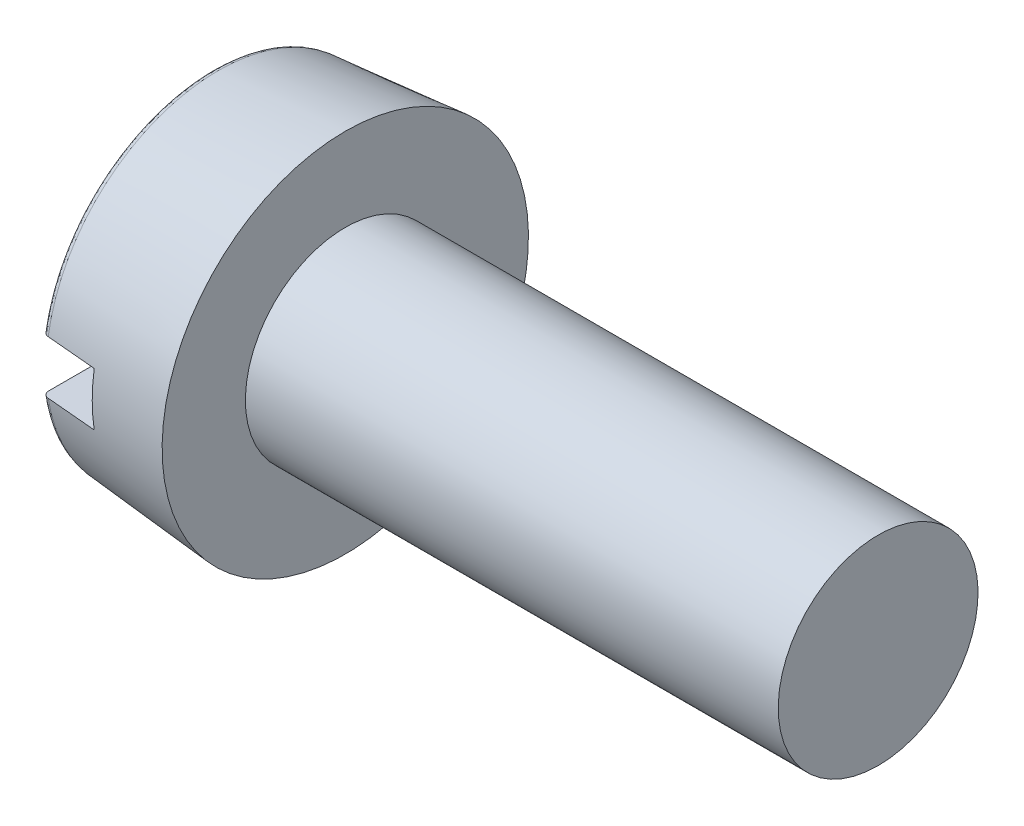
ISO-10303-21;
HEADER;
FILE_DESCRIPTION(('STEP AP214'),'2;1');
FILE_NAME('part.step','',(''),(''),'','','');
FILE_SCHEMA(('AUTOMOTIVE_DESIGN { 1 0 10303 214 1 1 1 1 }'));
ENDSEC;
DATA;
#1=APPLICATION_CONTEXT('core data for automotive mechanical design processes');
#2=APPLICATION_PROTOCOL_DEFINITION('international standard','automotive_design',2000,#1);
#3=PRODUCT_CONTEXT('',#1,'mechanical');
#4=PRODUCT('Part','Part','',(#3));
#5=PRODUCT_RELATED_PRODUCT_CATEGORY('part','',(#4));
#6=PRODUCT_DEFINITION_FORMATION('','',#4);
#7=PRODUCT_DEFINITION_CONTEXT('part definition',#1,'design');
#8=PRODUCT_DEFINITION('design','',#6,#7);
#9=PRODUCT_DEFINITION_SHAPE('','',#8);
#10=(LENGTH_UNIT() NAMED_UNIT(*) SI_UNIT(.MILLI.,.METRE.));
#11=(NAMED_UNIT(*) PLANE_ANGLE_UNIT() SI_UNIT($,.RADIAN.));
#12=(NAMED_UNIT(*) SI_UNIT($,.STERADIAN.) SOLID_ANGLE_UNIT());
#13=UNCERTAINTY_MEASURE_WITH_UNIT(LENGTH_MEASURE(1.E-05),#10,'distance_accuracy_value','');
#14=(GEOMETRIC_REPRESENTATION_CONTEXT(3) GLOBAL_UNCERTAINTY_ASSIGNED_CONTEXT((#13)) GLOBAL_UNIT_ASSIGNED_CONTEXT((#10,
#11,#12)) REPRESENTATION_CONTEXT('',''));
#15=CARTESIAN_POINT('',(0.,0.,0.));
#16=DIRECTION('',(0.,0.,1.));
#17=DIRECTION('',(1.,0.,0.));
#18=AXIS2_PLACEMENT_3D('',#15,#16,#17);
#19=CARTESIAN_POINT('',(0.,-0.4,2.650446542));
#20=DIRECTION('',(0.,-1.,0.));
#21=DIRECTION('',(0.,0.,-1.));
#22=AXIS2_PLACEMENT_3D('',#19,#20,#21);
#23=PLANE('',#22);
#24=CARTESIAN_POINT('',(-3.88264754801787E-10,-0.4,-2.45096382721289));
#25=CARTESIAN_POINT('',(8.23469277590213E-07,-0.400000000000683,-2.45672147849652));
#26=CARTESIAN_POINT('',(0.000485740539162257,-0.400000000000431,-2.46246889609489));
#27=CARTESIAN_POINT('',(0.00240753486794676,-0.399999999999569,-2.47380010316481));
#28=CARTESIAN_POINT('',(0.00384409442476151,-0.399999999998958,-2.47938394659553));
#29=CARTESIAN_POINT('',(0.00954542054326699,-0.399999999998849,-2.49564714861891));
#30=CARTESIAN_POINT('',(0.0152020603181267,-0.400000000001058,-2.50587617527297));
#31=CARTESIAN_POINT('',(0.0295560275156081,-0.399999999998943,-2.52377256067412));
#32=CARTESIAN_POINT('',(0.0382333783044966,-0.399999999994662,-2.53145611716201));
#33=CARTESIAN_POINT('',(0.0575844854018703,-0.399999999994604,-2.54337606647098));
#34=CARTESIAN_POINT('',(0.0682327265056606,-0.399999999998725,-2.54765317542582));
#35=CARTESIAN_POINT('',(0.0832192883416446,-0.400000000000461,-2.5508884248263));
#36=CARTESIAN_POINT('',(0.0872441554275944,-0.40000000000055,-2.55149900085297));
#37=CARTESIAN_POINT('',(0.0912844258242664,-0.399999999999937,-2.55184945172854));
#38=B_SPLINE_CURVE_WITH_KNOTS('',3,(#24,#25,#26,#27,#28,#29,#30,#31,#32,#33,#34,#35,#36,#37),
.UNSPECIFIED.,.F.,.F.,(4,2,2,2,2,2,4),(0.,0.0172324601899396,0.0344591702884396,
0.0688041676320151,0.102926218379292,0.13663402778301,0.148813672108883),.UNSPECIFIED.);
#39=CARTESIAN_POINT('',(-1.55305900850545E-10,-0.400000000229972,-2.45096382721289));
#40=VERTEX_POINT('',#39);
#41=CARTESIAN_POINT('',(0.0912844259120966,-0.399999999999968,-2.5518494516251));
#42=VERTEX_POINT('',#41);
#43=EDGE_CURVE('E100',#40,#42,#38,.T.);
#44=ORIENTED_EDGE('',*,*,#43,.F.);
#45=DIRECTION('',(0.,0.,-1.));
#46=VECTOR('',#45,1.);
#47=CARTESIAN_POINT('',(0.,-0.4,0.));
#48=LINE('',#47,#46);
#49=CARTESIAN_POINT('',(-1.55305900850545E-10,-0.400000000229972,2.45096382721289));
#50=VERTEX_POINT('',#49);
#51=EDGE_CURVE('E93',#50,#40,#48,.T.);
#52=ORIENTED_EDGE('',*,*,#51,.F.);
#53=CARTESIAN_POINT('',(0.0912844258227498,-0.4,2.5518494517284));
#54=CARTESIAN_POINT('',(0.0857148648744234,-0.400000000000016,2.55135621638075));
#55=CARTESIAN_POINT('',(0.0801975998035407,-0.400000000000008,2.5503899754913));
#56=CARTESIAN_POINT('',(0.069409338122753,-0.399999999999992,2.54754766453578));
#57=CARTESIAN_POINT('',(0.0641380702907059,-0.399999999999985,2.54567262374717));
#58=CARTESIAN_POINT('',(0.0489193196515725,-0.400000000000031,2.53875010258025));
#59=CARTESIAN_POINT('',(0.0395291097761964,-0.400000000000155,2.53240156020649));
#60=CARTESIAN_POINT('',(0.0233108199671268,-0.399999999999848,2.51695392511927));
#61=CARTESIAN_POINT('',(0.0164994426360841,-0.399999999999413,2.50783756819865));
#62=CARTESIAN_POINT('',(0.00615284354292489,-0.399999999999386,2.48774464580124));
#63=CARTESIAN_POINT('',(0.00265801971679152,-0.399999999999802,2.47674702132579));
#64=CARTESIAN_POINT('',(0.000340734068961633,-0.400000000000085,2.46069313066721));
#65=CARTESIAN_POINT('',(-9.49251235962126E-06,-0.40000000000013,2.45582329079742));
#66=CARTESIAN_POINT('',(-3.88264754859766E-10,-0.400000000000083,2.45096382721327));
#67=B_SPLINE_CURVE_WITH_KNOTS('',3,(#53,#54,#55,#56,#57,#58,#59,#60,#61,#62,#63,#64,#65,#66),
.UNSPECIFIED.,.F.,.F.,(4,2,2,2,2,2,4),(0.,0.0167339512516012,0.0334489942994423,
0.0667708029238235,0.100304881525151,0.134242375441344,0.148836154643942),.UNSPECIFIED.);
#68=CARTESIAN_POINT('',(0.0912844259211104,-0.4,2.55184945151469));
#69=VERTEX_POINT('',#68);
#70=EDGE_CURVE('E79',#69,#50,#67,.T.);
#71=ORIENTED_EDGE('',*,*,#70,.F.);
#72=CARTESIAN_POINT('',(0.850000000094597,-0.400000000175783,2.619018321802));
#73=CARTESIAN_POINT('',(0.72354710573568,-0.400000000087891,2.60782688353553));
#74=CARTESIAN_POINT('',(0.597094360702005,-0.400000000029297,2.59663375854446));
#75=CARTESIAN_POINT('',(0.344189169284567,-0.399999999970703,2.57424413511303));
#76=CARTESIAN_POINT('',(0.217736722900805,-0.399999999970703,2.56304763667267));
#77=CARTESIAN_POINT('',(0.0912844258422845,-0.4,2.5518494515077));
#78=B_SPLINE_CURVE_WITH_KNOTS('',3,(#72,#73,#74,#75,#76,#77),.UNSPECIFIED.,.F.,.F.,(4,2,4),(0.,
0.380841495851696,0.761682991705114),.UNSPECIFIED.);
#79=CARTESIAN_POINT('',(0.850000000275011,-0.4,2.61901832166631));
#80=VERTEX_POINT('',#79);
#81=EDGE_CURVE('E21',#80,#69,#78,.T.);
#82=ORIENTED_EDGE('',*,*,#81,.F.);
#83=DIRECTION('',(0.,0.,-1.));
#84=VECTOR('',#83,1.);
#85=CARTESIAN_POINT('',(0.85,-0.4,0.));
#86=LINE('',#85,#84);
#87=CARTESIAN_POINT('',(0.850000000275822,-0.4,-2.61901832166638));
#88=VERTEX_POINT('',#87);
#89=EDGE_CURVE('E77',#80,#88,#86,.T.);
#90=ORIENTED_EDGE('',*,*,#89,.T.);
#91=CARTESIAN_POINT('',(0.0912844258327621,-0.400000000147707,-2.55184945163379));
#92=CARTESIAN_POINT('',(0.217736722894637,-0.400000000073854,-2.56304763676087));
#93=CARTESIAN_POINT('',(0.344189169282115,-0.400000000024618,-2.57424413515924));
#94=CARTESIAN_POINT('',(0.597094360707707,-0.399999999975382,-2.59663375849853));
#95=CARTESIAN_POINT('',(0.723547105745822,-0.399999999975382,-2.60782688343945));
#96=CARTESIAN_POINT('',(0.85000000010954,-0.4,-2.61901832165167));
#97=B_SPLINE_CURVE_WITH_KNOTS('',3,(#91,#92,#93,#94,#95,#96),.UNSPECIFIED.,.F.,.F.,(4,2,4),(0.,
0.380841495853413,0.761682991705108),.UNSPECIFIED.);
#98=EDGE_CURVE('E97',#42,#88,#97,.T.);
#99=ORIENTED_EDGE('',*,*,#98,.F.);
#100=EDGE_LOOP('',(#44,#52,#71,#82,#90,#99));
#101=FACE_BOUND('',#100,.T.);
#102=ADVANCED_FACE('F17',(#101),#23,.F.);
#103=CARTESIAN_POINT('',(0.85,-0.4,2.681180693));
#104=DIRECTION('',(1.,0.,0.));
#105=DIRECTION('',(0.,0.,-1.));
#106=AXIS2_PLACEMENT_3D('',#103,#104,#105);
#107=PLANE('',#106);
#108=CARTESIAN_POINT('',(0.850000000442108,0.,0.));
#109=DIRECTION('',(1.,0.,0.));
#110=DIRECTION('',(0.,1.,0.));
#111=AXIS2_PLACEMENT_3D('',#108,#109,#110);
#112=CIRCLE('',#111,2.64938803675514);
#113=CARTESIAN_POINT('',(0.850000000255486,0.4,2.61901832166458));
#114=VERTEX_POINT('',#113);
#115=EDGE_CURVE('E84',#114,#80,#112,.T.);
#116=ORIENTED_EDGE('',*,*,#115,.F.);
#117=DIRECTION('',(0.,0.,-1.));
#118=VECTOR('',#117,1.);
#119=CARTESIAN_POINT('',(0.85,0.4,0.));
#120=LINE('',#119,#118);
#121=CARTESIAN_POINT('',(0.850000000221054,0.4,-2.61901832166153));
#122=VERTEX_POINT('',#121);
#123=EDGE_CURVE('E104',#114,#122,#120,.T.);
#124=ORIENTED_EDGE('',*,*,#123,.T.);
#125=CARTESIAN_POINT('',(0.850000000442108,0.,0.));
#126=DIRECTION('',(1.,0.,0.));
#127=DIRECTION('',(0.,1.,0.));
#128=AXIS2_PLACEMENT_3D('',#125,#126,#127);
#129=CIRCLE('',#128,2.64938803675514);
#130=EDGE_CURVE('E94',#88,#122,#129,.T.);
#131=ORIENTED_EDGE('',*,*,#130,.F.);
#132=ORIENTED_EDGE('',*,*,#89,.F.);
#133=EDGE_LOOP('',(#116,#124,#131,#132));
#134=FACE_BOUND('',#133,.T.);
#135=ADVANCED_FACE('F96',(#134),#107,.F.);
#136=CARTESIAN_POINT('',(0.,-2.495889893,-2.480375394));
#137=DIRECTION('',(-1.,0.,0.));
#138=DIRECTION('',(0.,0.,1.));
#139=AXIS2_PLACEMENT_3D('',#136,#137,#138);
#140=PLANE('',#139);
#141=ORIENTED_EDGE('',*,*,#51,.T.);
#142=CARTESIAN_POINT('',(-3.88264752088621E-10,-0.342851183630537,2.45960906493691));
#143=CARTESIAN_POINT('',(-3.8826475132627E-10,-4.1607756227118,1.9274188353991));
#144=CARTESIAN_POINT('',(-3.8826475132627E-10,-4.1607756227118,-1.9274188353991));
#145=CARTESIAN_POINT('',(-3.88264752088621E-10,-0.342851183630537,-2.45960906493691));
#146=(BOUNDED_CURVE() B_SPLINE_CURVE(3,(#142,#143,#144,#145),.UNSPECIFIED.,.F.,
.F.) B_SPLINE_CURVE_WITH_KNOTS((4,4),(0.,1.),
.UNSPECIFIED.) CURVE() GEOMETRIC_REPRESENTATION_ITEM() RATIONAL_B_SPLINE_CURVE((0.95905674209149,
0.407955726950188,0.407955726950188,0.95905674209149)) REPRESENTATION_ITEM(''));
#147=EDGE_CURVE('E111',#50,#40,#146,.T.);
#148=ORIENTED_EDGE('',*,*,#147,.F.);
#149=EDGE_LOOP('',(#141,#148));
#150=FACE_BOUND('',#149,.T.);
#151=ADVANCED_FACE('F118',(#150),#140,.T.);
#152=CARTESIAN_POINT('',(0.,0.4,-2.650446542));
#153=DIRECTION('',(0.,1.,0.));
#154=DIRECTION('',(0.,0.,1.));
#155=AXIS2_PLACEMENT_3D('',#152,#153,#154);
#156=PLANE('',#155);
#157=ORIENTED_EDGE('',*,*,#123,.F.);
#158=CARTESIAN_POINT('',(0.09128442584827,0.399999999997224,2.55184945150585));
#159=CARTESIAN_POINT('',(0.217736722896994,0.399999999998612,2.56304763669642));
#160=CARTESIAN_POINT('',(0.344189169273215,0.399999999999537,2.5742441351369));
#161=CARTESIAN_POINT('',(0.597094360680079,0.400000000000463,2.59663375851764));
#162=CARTESIAN_POINT('',(0.723547105710723,0.400000000000463,2.60782688345789));
#163=CARTESIAN_POINT('',(0.850000000068864,0.4,2.61901832164807));
#164=B_SPLINE_CURVE_WITH_KNOTS('',3,(#158,#159,#160,#161,#162,#163),.UNSPECIFIED.,.F.,.F.,(4,2,
4),(0.,0.380841495830915,0.76168299166011),.UNSPECIFIED.);
#165=CARTESIAN_POINT('',(0.0912844259141692,0.399999999999969,2.55184945162529));
#166=VERTEX_POINT('',#165);
#167=EDGE_CURVE('E89',#166,#114,#164,.T.);
#168=ORIENTED_EDGE('',*,*,#167,.F.);
#169=CARTESIAN_POINT('',(-3.88264754899792E-10,0.4,2.45096382721288));
#170=CARTESIAN_POINT('',(8.23469276589504E-07,0.400000000000683,2.4567214784965));
#171=CARTESIAN_POINT('',(0.00048574053916007,0.400000000000431,2.46246889609487));
#172=CARTESIAN_POINT('',(0.00240753486794207,0.399999999999569,2.47380010316479));
#173=CARTESIAN_POINT('',(0.00384409442475547,0.399999999998958,2.47938394659551));
#174=CARTESIAN_POINT('',(0.00954542054325717,0.399999999998849,2.4956471486189));
#175=CARTESIAN_POINT('',(0.0152020603181147,0.400000000001058,2.50587617527295));
#176=CARTESIAN_POINT('',(0.029556027515593,0.399999999998943,2.52377256067411));
#177=CARTESIAN_POINT('',(0.0382333783044807,0.399999999994662,2.531456117162));
#178=CARTESIAN_POINT('',(0.0575844854018479,0.399999999994604,2.54337606647098));
#179=CARTESIAN_POINT('',(0.0682327265056326,0.399999999998725,2.54765317542581));
#180=CARTESIAN_POINT('',(0.0832192883429883,0.400000000000461,2.5508884248266));
#181=CARTESIAN_POINT('',(0.0872441554303379,0.40000000000055,2.5514990008534));
#182=CARTESIAN_POINT('',(0.0912844258284116,0.399999999999937,2.55184945172891));
#183=B_SPLINE_CURVE_WITH_KNOTS('',3,(#169,#170,#171,#172,#173,#174,#175,#176,#177,#178,#179,
#180,#181,#182),.UNSPECIFIED.,.F.,.F.,(4,2,2,2,2,2,4),(0.,0.0172324601899393,0.0344591702884387,
0.0688041676320139,0.10292621837929,0.136634027783007,0.148813672113057),.UNSPECIFIED.);
#184=CARTESIAN_POINT('',(-1.55305900841723E-10,0.400000000230091,2.45096382721288));
#185=VERTEX_POINT('',#184);
#186=EDGE_CURVE('E41',#185,#166,#183,.T.);
#187=ORIENTED_EDGE('',*,*,#186,.F.);
#188=DIRECTION('',(0.,0.,1.));
#189=VECTOR('',#188,1.);
#190=CARTESIAN_POINT('',(0.,0.4,0.));
#191=LINE('',#190,#189);
#192=CARTESIAN_POINT('',(-1.55305900841723E-10,0.400000000230092,-2.45096382721288));
#193=VERTEX_POINT('',#192);
#194=EDGE_CURVE('E189',#193,#185,#191,.T.);
#195=ORIENTED_EDGE('',*,*,#194,.F.);
#196=CARTESIAN_POINT('',(0.0912844258256326,0.4,-2.55184945172866));
#197=CARTESIAN_POINT('',(0.0857148648772951,0.400000000000016,-2.55135621638117));
#198=CARTESIAN_POINT('',(0.0801975998063876,0.400000000000008,-2.55038997549189));
#199=CARTESIAN_POINT('',(0.0694093381255233,0.399999999999992,-2.54754766453668));
#200=CARTESIAN_POINT('',(0.0641380702934247,0.399999999999985,-2.54567262374823));
#201=CARTESIAN_POINT('',(0.0489193196540978,0.400000000000032,-2.53875010258176));
#202=CARTESIAN_POINT('',(0.0395291097785408,0.400000000000155,-2.53240156020827));
#203=CARTESIAN_POINT('',(0.0233108199690319,0.399999999999848,-2.51695392512154));
#204=CARTESIAN_POINT('',(0.0164994426377294,0.399999999999414,-2.50783756820113));
#205=CARTESIAN_POINT('',(0.00615284354399601,0.399999999999385,-2.48774464580404));
#206=CARTESIAN_POINT('',(0.00265801971754725,0.399999999999801,-2.47674702132872));
#207=CARTESIAN_POINT('',(0.000340734069101161,0.400000000000085,-2.4606931306692));
#208=CARTESIAN_POINT('',(-9.49251236520458E-06,0.40000000000013,-2.45582329079841));
#209=CARTESIAN_POINT('',(-3.8826475501002E-10,0.400000000000084,-2.45096382721325));
#210=B_SPLINE_CURVE_WITH_KNOTS('',3,(#196,#197,#198,#199,#200,#201,#202,#203,#204,#205,#206,
#207,#208,#209),.UNSPECIFIED.,.F.,.F.,(4,2,2,2,2,2,4),(0.,0.0167339512515908,0.0334489942994217,
0.066770802923782,0.100304881525078,0.134242375441233,0.14883615464685),.UNSPECIFIED.);
#211=CARTESIAN_POINT('',(0.0912844259225519,0.4,-2.55184945151482));
#212=VERTEX_POINT('',#211);
#213=EDGE_CURVE('E156',#212,#193,#210,.T.);
#214=ORIENTED_EDGE('',*,*,#213,.F.);
#215=CARTESIAN_POINT('',(0.850000000073007,0.4,-2.61901832164843));
#216=CARTESIAN_POINT('',(0.723547105713729,0.4,-2.60782688345776));
#217=CARTESIAN_POINT('',(0.597094360681914,0.4,-2.5966337585174));
#218=CARTESIAN_POINT('',(0.344189169272636,0.4,-2.57424413513724));
#219=CARTESIAN_POINT('',(0.217736722895173,0.4,-2.56304763669745));
#220=CARTESIAN_POINT('',(0.0912844258451723,0.4,-2.55184945150796));
#221=B_SPLINE_CURVE_WITH_KNOTS('',3,(#215,#216,#217,#218,#219,#220),.UNSPECIFIED.,.F.,.F.,(4,2,
4),(0.,0.380841495832725,0.761682991667168),.UNSPECIFIED.);
#222=EDGE_CURVE('E137',#122,#212,#221,.T.);
#223=ORIENTED_EDGE('',*,*,#222,.F.);
#224=EDGE_LOOP('',(#157,#168,#187,#195,#214,#223));
#225=FACE_BOUND('',#224,.T.);
#226=ADVANCED_FACE('F128',(#225),#156,.F.);
#227=CARTESIAN_POINT('',(0.000499583,-0.341472906,-2.449721322));
#228=CARTESIAN_POINT('',(0.000499583,-4.144049111,-1.919670522));
#229=CARTESIAN_POINT('',(0.000499583,-4.144049111,1.919670522));
#230=CARTESIAN_POINT('',(0.000499583,-0.341472906,2.449721322));
#231=CARTESIAN_POINT('',(-0.005885351,-0.3502584,-2.512748324));
#232=CARTESIAN_POINT('',(-0.005885351,-4.250668174,-1.969060253));
#233=CARTESIAN_POINT('',(-0.005885351,-4.250668174,1.969060253));
#234=CARTESIAN_POINT('',(-0.005885351,-0.3502584,2.512748324));
#235=CARTESIAN_POINT('',(0.037322619,-0.356768269,-2.559450018));
#236=CARTESIAN_POINT('',(0.037322619,-4.329670676,-2.005657014));
#237=CARTESIAN_POINT('',(0.037322619,-4.329670676,2.005657014));
#238=CARTESIAN_POINT('',(0.037322619,-0.356768269,2.559450018));
#239=CARTESIAN_POINT('',(0.101273319,-0.356655839,-2.558643453));
#240=CARTESIAN_POINT('',(0.101273319,-4.328306259,-2.005024967));
#241=CARTESIAN_POINT('',(0.101273319,-4.328306259,2.005024967));
#242=CARTESIAN_POINT('',(0.101273319,-0.356655839,2.558643453));
#243=(BOUNDED_SURFACE() B_SPLINE_SURFACE(3,3,((#227,#228,#229,#230),(#231,#232,#233,#234),(#235,
#236,#237,#238),(#239,#240,#241,#242)),.UNSPECIFIED.,.F.,.F.,
.F.) B_SPLINE_SURFACE_WITH_KNOTS((4,4),(4,4),(0.,1.),(0.,1.),
.UNSPECIFIED.) GEOMETRIC_REPRESENTATION_ITEM() RATIONAL_B_SPLINE_SURFACE(((1.,0.425371835727391,
0.425371835727391,1.),(0.77743169494117,0.330697547229782,0.330697547229782,0.77743169494117),
(0.77743169494117,0.330697547229782,0.330697547229782,0.77743169494117),(1.,0.425371835727391,
0.425371835727391,1.))) REPRESENTATION_ITEM('') SURFACE());
#244=CARTESIAN_POINT('',(0.0912844259999268,0.,0.));
#245=DIRECTION('',(1.,0.,0.));
#246=DIRECTION('',(0.,0.,-1.));
#247=AXIS2_PLACEMENT_3D('',#244,#245,#246);
#248=CIRCLE('',#247,2.583009025);
#249=EDGE_CURVE('E181',#42,#69,#248,.F.);
#250=ORIENTED_EDGE('',*,*,#70,.T.);
#251=ORIENTED_EDGE('',*,*,#147,.T.);
#252=ORIENTED_EDGE('',*,*,#43,.T.);
#253=ORIENTED_EDGE('',*,*,#249,.T.);
#254=EDGE_LOOP('',(#250,#251,#252,#253));
#255=FACE_BOUND('',#254,.T.);
#256=ADVANCED_FACE('F132',(#255),#243,.T.);
#257=CARTESIAN_POINT('',(10.,-1.518,1.518));
#258=DIRECTION('',(1.,0.,0.));
#259=DIRECTION('',(0.,0.,-1.));
#260=AXIS2_PLACEMENT_3D('',#257,#258,#259);
#261=PLANE('',#260);
#262=CARTESIAN_POINT('',(10.,0.,0.));
#263=DIRECTION('',(-1.,0.,0.));
#264=DIRECTION('',(0.,-1.,0.));
#265=AXIS2_PLACEMENT_3D('',#262,#263,#264);
#266=CIRCLE('',#265,1.5);
#267=CARTESIAN_POINT('',(10.,-1.5,0.));
#268=VERTEX_POINT('',#267);
#269=EDGE_CURVE('E188',#268,#268,#266,.F.);
#270=ORIENTED_EDGE('',*,*,#269,.T.);
#271=EDGE_LOOP('',(#270));
#272=FACE_BOUND('',#271,.T.);
#273=ADVANCED_FACE('F133',(#272),#261,.T.);
#274=CARTESIAN_POINT('',(0.,0.4,-2.480375394));
#275=DIRECTION('',(-1.,0.,0.));
#276=DIRECTION('',(0.,0.,1.));
#277=AXIS2_PLACEMENT_3D('',#274,#275,#276);
#278=PLANE('',#277);
#279=ORIENTED_EDGE('',*,*,#194,.T.);
#280=CARTESIAN_POINT('',(-3.88264752064926E-10,0.342851183630537,-2.45960906493691));
#281=CARTESIAN_POINT('',(-3.88264751740256E-10,4.1607756227118,-1.9274188353991));
#282=CARTESIAN_POINT('',(-3.88264751740256E-10,4.1607756227118,1.9274188353991));
#283=CARTESIAN_POINT('',(-3.88264752064926E-10,0.342851183630537,2.45960906493691));
#284=(BOUNDED_CURVE() B_SPLINE_CURVE(3,(#280,#281,#282,#283),.UNSPECIFIED.,.F.,
.F.) B_SPLINE_CURVE_WITH_KNOTS((4,4),(0.,1.),
.UNSPECIFIED.) CURVE() GEOMETRIC_REPRESENTATION_ITEM() RATIONAL_B_SPLINE_CURVE((0.959056742091488,
0.407955726952357,0.407955726952357,0.959056742091488)) REPRESENTATION_ITEM(''));
#285=EDGE_CURVE('E233',#193,#185,#284,.T.);
#286=ORIENTED_EDGE('',*,*,#285,.F.);
#287=EDGE_LOOP('',(#279,#286));
#288=FACE_BOUND('',#287,.T.);
#289=ADVANCED_FACE('F242',(#288),#278,.T.);
#290=CARTESIAN_POINT('',(10.,0.,0.));
#291=DIRECTION('',(-1.,0.,0.));
#292=DIRECTION('',(0.,-1.,0.));
#293=AXIS2_PLACEMENT_3D('',#290,#291,#292);
#294=CYLINDRICAL_SURFACE('',#293,1.5);
#295=CARTESIAN_POINT('',(2.,0.,0.));
#296=DIRECTION('',(-1.,0.,0.));
#297=DIRECTION('',(0.,-1.,0.));
#298=AXIS2_PLACEMENT_3D('',#295,#296,#297);
#299=CIRCLE('',#298,1.5);
#300=CARTESIAN_POINT('',(2.,-1.5,0.));
#301=VERTEX_POINT('',#300);
#302=EDGE_CURVE('E231',#301,#301,#299,.F.);
#303=ORIENTED_EDGE('',*,*,#302,.T.);
#304=EDGE_LOOP('',(#303));
#305=FACE_BOUND('',#304,.T.);
#306=ORIENTED_EDGE('',*,*,#269,.F.);
#307=EDGE_LOOP('',(#306));
#308=FACE_BOUND('',#307,.T.);
#309=ADVANCED_FACE('F163',(#305,#308),#294,.T.);
#310=CARTESIAN_POINT('',(0.000499583,0.341472906,2.449721322));
#311=CARTESIAN_POINT('',(0.000499583,4.144049111,1.919670522));
#312=CARTESIAN_POINT('',(0.000499583,4.144049111,-1.919670522));
#313=CARTESIAN_POINT('',(0.000499583,0.341472906,-2.449721322));
#314=CARTESIAN_POINT('',(-0.005885351,0.3502584,2.512748324));
#315=CARTESIAN_POINT('',(-0.005885351,4.250668174,1.969060253));
#316=CARTESIAN_POINT('',(-0.005885351,4.250668174,-1.969060253));
#317=CARTESIAN_POINT('',(-0.005885351,0.3502584,-2.512748324));
#318=CARTESIAN_POINT('',(0.037322619,0.356768269,2.559450018));
#319=CARTESIAN_POINT('',(0.037322619,4.329670676,2.005657014));
#320=CARTESIAN_POINT('',(0.037322619,4.329670676,-2.005657014));
#321=CARTESIAN_POINT('',(0.037322619,0.356768269,-2.559450018));
#322=CARTESIAN_POINT('',(0.101273319,0.356655839,2.558643453));
#323=CARTESIAN_POINT('',(0.101273319,4.328306259,2.005024967));
#324=CARTESIAN_POINT('',(0.101273319,4.328306259,-2.005024967));
#325=CARTESIAN_POINT('',(0.101273319,0.356655839,-2.558643453));
#326=(BOUNDED_SURFACE() B_SPLINE_SURFACE(3,3,((#310,#311,#312,#313),(#314,#315,#316,#317),(#318,
#319,#320,#321),(#322,#323,#324,#325)),.UNSPECIFIED.,.F.,.F.,
.F.) B_SPLINE_SURFACE_WITH_KNOTS((4,4),(4,4),(0.,1.),(0.,1.),
.UNSPECIFIED.) GEOMETRIC_REPRESENTATION_ITEM() RATIONAL_B_SPLINE_SURFACE(((1.,0.425371835729653,
0.425371835729653,1.),(0.77743169494117,0.330697547231541,0.330697547231541,0.77743169494117),
(0.77743169494117,0.330697547231541,0.330697547231541,0.77743169494117),(1.,0.425371835729653,
0.425371835729653,1.))) REPRESENTATION_ITEM('') SURFACE());
#327=CARTESIAN_POINT('',(0.0912844259999268,0.,0.));
#328=DIRECTION('',(1.,0.,0.));
#329=DIRECTION('',(0.,0.,-1.));
#330=AXIS2_PLACEMENT_3D('',#327,#328,#329);
#331=CIRCLE('',#330,2.583009025);
#332=EDGE_CURVE('E32',#166,#212,#331,.F.);
#333=ORIENTED_EDGE('',*,*,#186,.T.);
#334=ORIENTED_EDGE('',*,*,#332,.T.);
#335=ORIENTED_EDGE('',*,*,#213,.T.);
#336=ORIENTED_EDGE('',*,*,#285,.T.);
#337=EDGE_LOOP('',(#333,#334,#335,#336));
#338=FACE_BOUND('',#337,.T.);
#339=ADVANCED_FACE('F157',(#338),#326,.T.);
#340=CARTESIAN_POINT('',(2.,-2.783,-2.783));
#341=DIRECTION('',(-1.,0.,0.));
#342=DIRECTION('',(0.,0.,1.));
#343=AXIS2_PLACEMENT_3D('',#340,#341,#342);
#344=PLANE('',#343);
#345=ORIENTED_EDGE('',*,*,#302,.F.);
#346=EDGE_LOOP('',(#345));
#347=FACE_BOUND('',#346,.T.);
#348=CARTESIAN_POINT('',(2.,0.,0.));
#349=DIRECTION('',(1.,0.,0.));
#350=DIRECTION('',(0.,1.,0.));
#351=AXIS2_PLACEMENT_3D('',#348,#349,#350);
#352=CIRCLE('',#351,2.75);
#353=CARTESIAN_POINT('',(2.,2.75,0.));
#354=VERTEX_POINT('',#353);
#355=EDGE_CURVE('E11',#354,#354,#352,.T.);
#356=ORIENTED_EDGE('',*,*,#355,.T.);
#357=EDGE_LOOP('',(#356));
#358=FACE_BOUND('',#357,.T.);
#359=ADVANCED_FACE('F19',(#347,#358),#344,.F.);
#360=CARTESIAN_POINT('',(0.091284426,0.,0.));
#361=DIRECTION('',(1.,0.,0.));
#362=DIRECTION('',(0.,1.,0.));
#363=AXIS2_PLACEMENT_3D('',#360,#361,#362);
#364=CONICAL_SURFACE('',#363,2.583009025,0.0872664627970948);
#365=ORIENTED_EDGE('',*,*,#98,.T.);
#366=ORIENTED_EDGE('',*,*,#130,.T.);
#367=ORIENTED_EDGE('',*,*,#222,.T.);
#368=ORIENTED_EDGE('',*,*,#332,.F.);
#369=ORIENTED_EDGE('',*,*,#167,.T.);
#370=ORIENTED_EDGE('',*,*,#115,.T.);
#371=ORIENTED_EDGE('',*,*,#81,.T.);
#372=ORIENTED_EDGE('',*,*,#249,.F.);
#373=EDGE_LOOP('',(#365,#366,#367,#368,#369,#370,#371,#372));
#374=FACE_BOUND('',#373,.T.);
#375=ORIENTED_EDGE('',*,*,#355,.F.);
#376=EDGE_LOOP('',(#375));
#377=FACE_BOUND('',#376,.T.);
#378=ADVANCED_FACE('F86',(#374,#377),#364,.T.);
#379=CLOSED_SHELL('',(#102,#135,#151,#226,#256,#273,#289,#309,#339,#359,#378));
#380=MANIFOLD_SOLID_BREP('B1',#379);
#381=ADVANCED_BREP_SHAPE_REPRESENTATION('',(#18,#380),#14);
#382=SHAPE_DEFINITION_REPRESENTATION(#9,#381);
ENDSEC;
END-ISO-10303-21;
